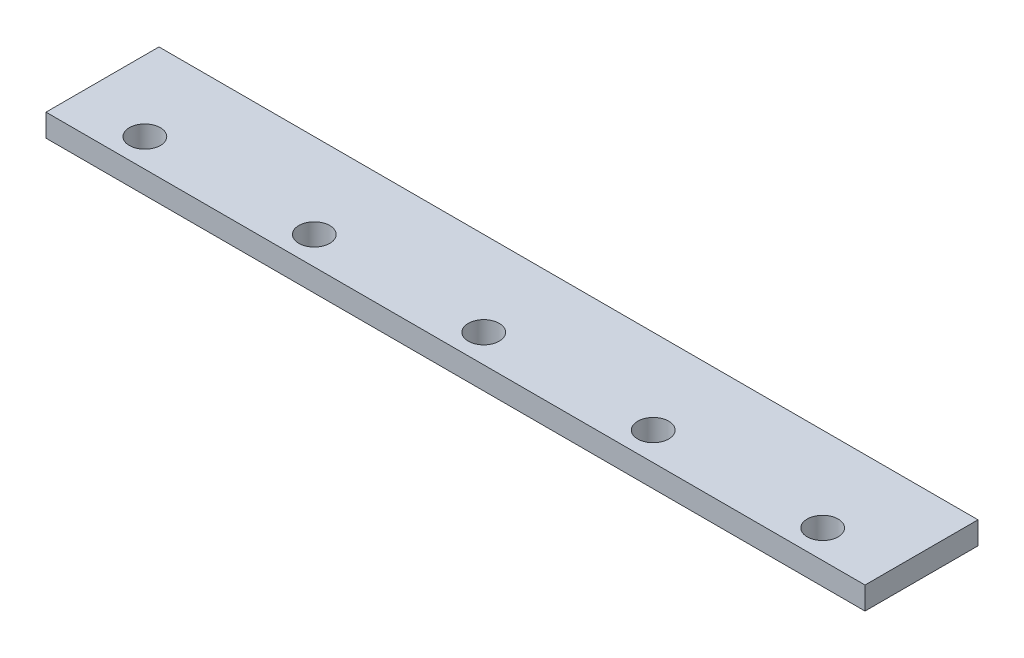
ISO-10303-21;
HEADER;
FILE_DESCRIPTION(('STEP AP214'),'2;1');
FILE_NAME('part.step','',(''),(''),'','','');
FILE_SCHEMA(('AUTOMOTIVE_DESIGN { 1 0 10303 214 1 1 1 1 }'));
ENDSEC;
DATA;
#1=APPLICATION_CONTEXT('core data for automotive mechanical design processes');
#2=APPLICATION_PROTOCOL_DEFINITION('international standard','automotive_design',2000,#1);
#3=PRODUCT_CONTEXT('',#1,'mechanical');
#4=PRODUCT('Part','Part','',(#3));
#5=PRODUCT_RELATED_PRODUCT_CATEGORY('part','',(#4));
#6=PRODUCT_DEFINITION_FORMATION('','',#4);
#7=PRODUCT_DEFINITION_CONTEXT('part definition',#1,'design');
#8=PRODUCT_DEFINITION('design','',#6,#7);
#9=PRODUCT_DEFINITION_SHAPE('','',#8);
#10=(LENGTH_UNIT() NAMED_UNIT(*) SI_UNIT(.MILLI.,.METRE.));
#11=(NAMED_UNIT(*) PLANE_ANGLE_UNIT() SI_UNIT($,.RADIAN.));
#12=(NAMED_UNIT(*) SI_UNIT($,.STERADIAN.) SOLID_ANGLE_UNIT());
#13=UNCERTAINTY_MEASURE_WITH_UNIT(LENGTH_MEASURE(1.E-05),#10,'distance_accuracy_value','');
#14=(GEOMETRIC_REPRESENTATION_CONTEXT(3) GLOBAL_UNCERTAINTY_ASSIGNED_CONTEXT((#13)) GLOBAL_UNIT_ASSIGNED_CONTEXT((#10,
#11,#12)) REPRESENTATION_CONTEXT('',''));
#15=CARTESIAN_POINT('',(0.,0.,0.));
#16=DIRECTION('',(0.,0.,1.));
#17=DIRECTION('',(1.,0.,0.));
#18=AXIS2_PLACEMENT_3D('',#15,#16,#17);
#19=CARTESIAN_POINT('',(20.3152364273204,160.,688.091068301226));
#20=DIRECTION('',(1.,0.,0.));
#21=DIRECTION('',(0.,0.,-1.));
#22=AXIS2_PLACEMENT_3D('',#19,#20,#21);
#23=PLANE('',#22);
#24=DIRECTION('',(0.,0.,1.));
#25=VECTOR('',#24,1.);
#26=CARTESIAN_POINT('',(20.3152364273204,0.,688.091068301226));
#27=LINE('',#26,#25);
#28=CARTESIAN_POINT('',(20.3152364273204,0.,688.091068301226));
#29=VERTEX_POINT('',#28);
#30=CARTESIAN_POINT('',(20.3152364273204,0.,1488.09106830123));
#31=VERTEX_POINT('',#30);
#32=EDGE_CURVE('E102',#29,#31,#27,.T.);
#33=ORIENTED_EDGE('',*,*,#32,.T.);
#34=DIRECTION('',(0.,-1.,0.));
#35=VECTOR('',#34,1.);
#36=CARTESIAN_POINT('',(20.3152364273204,160.,1488.09106830123));
#37=LINE('',#36,#35);
#38=CARTESIAN_POINT('',(20.3152364273204,160.,1488.09106830123));
#39=VERTEX_POINT('',#38);
#40=EDGE_CURVE('E93',#39,#31,#37,.T.);
#41=ORIENTED_EDGE('',*,*,#40,.F.);
#42=DIRECTION('',(0.,0.,1.));
#43=VECTOR('',#42,1.);
#44=CARTESIAN_POINT('',(20.3152364273204,160.,688.091068301226));
#45=LINE('',#44,#43);
#46=CARTESIAN_POINT('',(20.3152364273204,160.,688.091068301226));
#47=VERTEX_POINT('',#46);
#48=EDGE_CURVE('E87',#47,#39,#45,.T.);
#49=ORIENTED_EDGE('',*,*,#48,.F.);
#50=DIRECTION('',(0.,-1.,0.));
#51=VECTOR('',#50,1.);
#52=CARTESIAN_POINT('',(20.3152364273204,160.,688.091068301226));
#53=LINE('',#52,#51);
#54=EDGE_CURVE('E98',#47,#29,#53,.T.);
#55=ORIENTED_EDGE('',*,*,#54,.T.);
#56=EDGE_LOOP('',(#33,#41,#49,#55));
#57=FACE_BOUND('',#56,.T.);
#58=ADVANCED_FACE('F33',(#57),#23,.F.);
#59=CARTESIAN_POINT('',(20.3152364273204,160.,1488.09106830123));
#60=DIRECTION('',(0.,0.,-1.));
#61=DIRECTION('',(-1.,0.,0.));
#62=AXIS2_PLACEMENT_3D('',#59,#60,#61);
#63=PLANE('',#62);
#64=DIRECTION('',(1.,0.,0.));
#65=VECTOR('',#64,1.);
#66=CARTESIAN_POINT('',(20.3152364273204,0.,1488.09106830123));
#67=LINE('',#66,#65);
#68=CARTESIAN_POINT('',(5820.31523642732,0.,1488.09106830123));
#69=VERTEX_POINT('',#68);
#70=EDGE_CURVE('E92',#31,#69,#67,.T.);
#71=ORIENTED_EDGE('',*,*,#70,.T.);
#72=DIRECTION('',(0.,-1.,0.));
#73=VECTOR('',#72,1.);
#74=CARTESIAN_POINT('',(5820.31523642732,160.,1488.09106830123));
#75=LINE('',#74,#73);
#76=CARTESIAN_POINT('',(5820.31523642732,160.,1488.09106830123));
#77=VERTEX_POINT('',#76);
#78=EDGE_CURVE('E90',#77,#69,#75,.T.);
#79=ORIENTED_EDGE('',*,*,#78,.F.);
#80=DIRECTION('',(1.,0.,0.));
#81=VECTOR('',#80,1.);
#82=CARTESIAN_POINT('',(20.3152364273204,160.,1488.09106830123));
#83=LINE('',#82,#81);
#84=EDGE_CURVE('E81',#39,#77,#83,.T.);
#85=ORIENTED_EDGE('',*,*,#84,.F.);
#86=ORIENTED_EDGE('',*,*,#40,.T.);
#87=EDGE_LOOP('',(#71,#79,#85,#86));
#88=FACE_BOUND('',#87,.T.);
#89=ADVANCED_FACE('F91',(#88),#63,.F.);
#90=CARTESIAN_POINT('',(5820.31523642732,160.,688.091068301226));
#91=DIRECTION('',(-1.,0.,0.));
#92=DIRECTION('',(0.,0.,1.));
#93=AXIS2_PLACEMENT_3D('',#90,#91,#92);
#94=PLANE('',#93);
#95=DIRECTION('',(0.,0.,-1.));
#96=VECTOR('',#95,1.);
#97=CARTESIAN_POINT('',(5820.31523642732,0.,688.091068301226));
#98=LINE('',#97,#96);
#99=CARTESIAN_POINT('',(5820.31523642732,0.,688.091068301226));
#100=VERTEX_POINT('',#99);
#101=EDGE_CURVE('E67',#69,#100,#98,.T.);
#102=ORIENTED_EDGE('',*,*,#101,.T.);
#103=DIRECTION('',(0.,-1.,0.));
#104=VECTOR('',#103,1.);
#105=CARTESIAN_POINT('',(5820.31523642732,160.,688.091068301226));
#106=LINE('',#105,#104);
#107=CARTESIAN_POINT('',(5820.31523642732,160.,688.091068301226));
#108=VERTEX_POINT('',#107);
#109=EDGE_CURVE('E94',#108,#100,#106,.T.);
#110=ORIENTED_EDGE('',*,*,#109,.F.);
#111=DIRECTION('',(0.,0.,-1.));
#112=VECTOR('',#111,1.);
#113=CARTESIAN_POINT('',(5820.31523642732,160.,688.091068301226));
#114=LINE('',#113,#112);
#115=EDGE_CURVE('E85',#77,#108,#114,.T.);
#116=ORIENTED_EDGE('',*,*,#115,.F.);
#117=ORIENTED_EDGE('',*,*,#78,.T.);
#118=EDGE_LOOP('',(#102,#110,#116,#117));
#119=FACE_BOUND('',#118,.T.);
#120=ADVANCED_FACE('F96',(#119),#94,.F.);
#121=CARTESIAN_POINT('',(20.3152364273204,160.,688.091068301226));
#122=DIRECTION('',(0.,0.,1.));
#123=DIRECTION('',(1.,0.,0.));
#124=AXIS2_PLACEMENT_3D('',#121,#122,#123);
#125=PLANE('',#124);
#126=DIRECTION('',(-1.,0.,0.));
#127=VECTOR('',#126,1.);
#128=CARTESIAN_POINT('',(20.3152364273204,0.,688.091068301226));
#129=LINE('',#128,#127);
#130=EDGE_CURVE('E73',#100,#29,#129,.T.);
#131=ORIENTED_EDGE('',*,*,#130,.T.);
#132=ORIENTED_EDGE('',*,*,#54,.F.);
#133=DIRECTION('',(-1.,0.,0.));
#134=VECTOR('',#133,1.);
#135=CARTESIAN_POINT('',(20.3152364273204,160.,688.091068301226));
#136=LINE('',#135,#134);
#137=EDGE_CURVE('E50',#108,#47,#136,.T.);
#138=ORIENTED_EDGE('',*,*,#137,.F.);
#139=ORIENTED_EDGE('',*,*,#109,.T.);
#140=EDGE_LOOP('',(#131,#132,#138,#139));
#141=FACE_BOUND('',#140,.T.);
#142=ADVANCED_FACE('F134',(#141),#125,.F.);
#143=CARTESIAN_POINT('',(0.,160.,0.));
#144=DIRECTION('',(0.,1.,0.));
#145=DIRECTION('',(0.,0.,1.));
#146=AXIS2_PLACEMENT_3D('',#143,#144,#145);
#147=PLANE('',#146);
#148=CARTESIAN_POINT('',(1720.31523642732,160.,1288.09106830123));
#149=DIRECTION('',(0.,1.,0.));
#150=DIRECTION('',(0.,0.,1.));
#151=AXIS2_PLACEMENT_3D('',#148,#149,#150);
#152=CIRCLE('',#151,109.705286938289);
#153=CARTESIAN_POINT('',(1720.31523642732,160.,1397.79635523951));
#154=VERTEX_POINT('',#153);
#155=EDGE_CURVE('E242',#154,#154,#152,.T.);
#156=ORIENTED_EDGE('',*,*,#155,.F.);
#157=EDGE_LOOP('',(#156));
#158=FACE_BOUND('',#157,.T.);
#159=CARTESIAN_POINT('',(520.31523642732,160.,1288.09106830123));
#160=DIRECTION('',(0.,1.,0.));
#161=DIRECTION('',(0.,0.,1.));
#162=AXIS2_PLACEMENT_3D('',#159,#160,#161);
#163=CIRCLE('',#162,109.705286938289);
#164=CARTESIAN_POINT('',(520.31523642732,160.,1397.79635523951));
#165=VERTEX_POINT('',#164);
#166=EDGE_CURVE('E241',#165,#165,#163,.T.);
#167=ORIENTED_EDGE('',*,*,#166,.F.);
#168=EDGE_LOOP('',(#167));
#169=FACE_BOUND('',#168,.T.);
#170=ORIENTED_EDGE('',*,*,#48,.T.);
#171=ORIENTED_EDGE('',*,*,#84,.T.);
#172=ORIENTED_EDGE('',*,*,#115,.T.);
#173=ORIENTED_EDGE('',*,*,#137,.T.);
#174=EDGE_LOOP('',(#170,#171,#172,#173));
#175=FACE_BOUND('',#174,.T.);
#176=CARTESIAN_POINT('',(2920.31523642732,160.,1288.09106830123));
#177=DIRECTION('',(0.,1.,0.));
#178=DIRECTION('',(0.,0.,1.));
#179=AXIS2_PLACEMENT_3D('',#176,#177,#178);
#180=CIRCLE('',#179,109.705286938289);
#181=CARTESIAN_POINT('',(2920.31523642732,160.,1397.79635523951));
#182=VERTEX_POINT('',#181);
#183=EDGE_CURVE('E115',#182,#182,#180,.T.);
#184=ORIENTED_EDGE('',*,*,#183,.F.);
#185=EDGE_LOOP('',(#184));
#186=FACE_BOUND('',#185,.T.);
#187=CARTESIAN_POINT('',(4120.31523642732,160.,1288.09106830123));
#188=DIRECTION('',(0.,1.,0.));
#189=DIRECTION('',(0.,0.,1.));
#190=AXIS2_PLACEMENT_3D('',#187,#188,#189);
#191=CIRCLE('',#190,109.705286938289);
#192=CARTESIAN_POINT('',(4120.31523642732,160.,1397.79635523951));
#193=VERTEX_POINT('',#192);
#194=EDGE_CURVE('E121',#193,#193,#191,.T.);
#195=ORIENTED_EDGE('',*,*,#194,.F.);
#196=EDGE_LOOP('',(#195));
#197=FACE_BOUND('',#196,.T.);
#198=CARTESIAN_POINT('',(5320.31523642732,160.,1288.09106830123));
#199=DIRECTION('',(0.,1.,0.));
#200=DIRECTION('',(0.,0.,1.));
#201=AXIS2_PLACEMENT_3D('',#198,#199,#200);
#202=CIRCLE('',#201,109.705286938289);
#203=CARTESIAN_POINT('',(5320.31523642732,160.,1397.79635523951));
#204=VERTEX_POINT('',#203);
#205=EDGE_CURVE('E11',#204,#204,#202,.T.);
#206=ORIENTED_EDGE('',*,*,#205,.F.);
#207=EDGE_LOOP('',(#206));
#208=FACE_BOUND('',#207,.T.);
#209=ADVANCED_FACE('F82',(#158,#169,#175,#186,#197,#208),#147,.T.);
#210=CARTESIAN_POINT('',(0.,0.,0.));
#211=DIRECTION('',(0.,1.,0.));
#212=DIRECTION('',(0.,0.,1.));
#213=AXIS2_PLACEMENT_3D('',#210,#211,#212);
#214=PLANE('',#213);
#215=CARTESIAN_POINT('',(1720.31523642732,0.,1288.09106830123));
#216=DIRECTION('',(0.,1.,0.));
#217=DIRECTION('',(0.,0.,1.));
#218=AXIS2_PLACEMENT_3D('',#215,#216,#217);
#219=CIRCLE('',#218,109.705286938289);
#220=CARTESIAN_POINT('',(1720.31523642732,0.,1397.79635523951));
#221=VERTEX_POINT('',#220);
#222=EDGE_CURVE('E246',#221,#221,#219,.T.);
#223=ORIENTED_EDGE('',*,*,#222,.T.);
#224=EDGE_LOOP('',(#223));
#225=FACE_BOUND('',#224,.T.);
#226=CARTESIAN_POINT('',(520.31523642732,0.,1288.09106830123));
#227=DIRECTION('',(0.,1.,0.));
#228=DIRECTION('',(0.,0.,1.));
#229=AXIS2_PLACEMENT_3D('',#226,#227,#228);
#230=CIRCLE('',#229,109.705286938289);
#231=CARTESIAN_POINT('',(520.31523642732,0.,1397.79635523951));
#232=VERTEX_POINT('',#231);
#233=EDGE_CURVE('E105',#232,#232,#230,.T.);
#234=ORIENTED_EDGE('',*,*,#233,.T.);
#235=EDGE_LOOP('',(#234));
#236=FACE_BOUND('',#235,.T.);
#237=ORIENTED_EDGE('',*,*,#32,.F.);
#238=ORIENTED_EDGE('',*,*,#130,.F.);
#239=ORIENTED_EDGE('',*,*,#101,.F.);
#240=ORIENTED_EDGE('',*,*,#70,.F.);
#241=EDGE_LOOP('',(#237,#238,#239,#240));
#242=FACE_BOUND('',#241,.T.);
#243=CARTESIAN_POINT('',(2920.31523642732,0.,1288.09106830123));
#244=DIRECTION('',(0.,1.,0.));
#245=DIRECTION('',(0.,0.,1.));
#246=AXIS2_PLACEMENT_3D('',#243,#244,#245);
#247=CIRCLE('',#246,109.705286938289);
#248=CARTESIAN_POINT('',(2920.31523642732,0.,1397.79635523951));
#249=VERTEX_POINT('',#248);
#250=EDGE_CURVE('E112',#249,#249,#247,.T.);
#251=ORIENTED_EDGE('',*,*,#250,.T.);
#252=EDGE_LOOP('',(#251));
#253=FACE_BOUND('',#252,.T.);
#254=CARTESIAN_POINT('',(4120.31523642732,0.,1288.09106830123));
#255=DIRECTION('',(0.,1.,0.));
#256=DIRECTION('',(0.,0.,1.));
#257=AXIS2_PLACEMENT_3D('',#254,#255,#256);
#258=CIRCLE('',#257,109.705286938289);
#259=CARTESIAN_POINT('',(4120.31523642732,0.,1397.79635523951));
#260=VERTEX_POINT('',#259);
#261=EDGE_CURVE('E118',#260,#260,#258,.T.);
#262=ORIENTED_EDGE('',*,*,#261,.T.);
#263=EDGE_LOOP('',(#262));
#264=FACE_BOUND('',#263,.T.);
#265=CARTESIAN_POINT('',(5320.31523642732,0.,1288.09106830123));
#266=DIRECTION('',(0.,1.,0.));
#267=DIRECTION('',(0.,0.,1.));
#268=AXIS2_PLACEMENT_3D('',#265,#266,#267);
#269=CIRCLE('',#268,109.705286938289);
#270=CARTESIAN_POINT('',(5320.31523642732,0.,1397.79635523951));
#271=VERTEX_POINT('',#270);
#272=EDGE_CURVE('E42',#271,#271,#269,.T.);
#273=ORIENTED_EDGE('',*,*,#272,.T.);
#274=EDGE_LOOP('',(#273));
#275=FACE_BOUND('',#274,.T.);
#276=ADVANCED_FACE('F126',(#225,#236,#242,#253,#264,#275),#214,.F.);
#277=CARTESIAN_POINT('',(520.31523642732,0.,1288.09106830123));
#278=DIRECTION('',(0.,1.,0.));
#279=DIRECTION('',(0.,0.,1.));
#280=AXIS2_PLACEMENT_3D('',#277,#278,#279);
#281=CYLINDRICAL_SURFACE('',#280,109.705286938289);
#282=ORIENTED_EDGE('',*,*,#233,.F.);
#283=EDGE_LOOP('',(#282));
#284=FACE_BOUND('',#283,.T.);
#285=ORIENTED_EDGE('',*,*,#166,.T.);
#286=EDGE_LOOP('',(#285));
#287=FACE_BOUND('',#286,.T.);
#288=ADVANCED_FACE('F141',(#284,#287),#281,.F.);
#289=CARTESIAN_POINT('',(1720.31523642732,0.,1288.09106830123));
#290=DIRECTION('',(0.,1.,0.));
#291=DIRECTION('',(0.,0.,1.));
#292=AXIS2_PLACEMENT_3D('',#289,#290,#291);
#293=CYLINDRICAL_SURFACE('',#292,109.705286938289);
#294=ORIENTED_EDGE('',*,*,#222,.F.);
#295=EDGE_LOOP('',(#294));
#296=FACE_BOUND('',#295,.T.);
#297=ORIENTED_EDGE('',*,*,#155,.T.);
#298=EDGE_LOOP('',(#297));
#299=FACE_BOUND('',#298,.T.);
#300=ADVANCED_FACE('F159',(#296,#299),#293,.F.);
#301=CARTESIAN_POINT('',(2920.31523642732,0.,1288.09106830123));
#302=DIRECTION('',(0.,1.,0.));
#303=DIRECTION('',(0.,0.,1.));
#304=AXIS2_PLACEMENT_3D('',#301,#302,#303);
#305=CYLINDRICAL_SURFACE('',#304,109.705286938289);
#306=ORIENTED_EDGE('',*,*,#250,.F.);
#307=EDGE_LOOP('',(#306));
#308=FACE_BOUND('',#307,.T.);
#309=ORIENTED_EDGE('',*,*,#183,.T.);
#310=EDGE_LOOP('',(#309));
#311=FACE_BOUND('',#310,.T.);
#312=ADVANCED_FACE('F157',(#308,#311),#305,.F.);
#313=CARTESIAN_POINT('',(4120.31523642732,0.,1288.09106830123));
#314=DIRECTION('',(0.,1.,0.));
#315=DIRECTION('',(0.,0.,1.));
#316=AXIS2_PLACEMENT_3D('',#313,#314,#315);
#317=CYLINDRICAL_SURFACE('',#316,109.705286938289);
#318=ORIENTED_EDGE('',*,*,#261,.F.);
#319=EDGE_LOOP('',(#318));
#320=FACE_BOUND('',#319,.T.);
#321=ORIENTED_EDGE('',*,*,#194,.T.);
#322=EDGE_LOOP('',(#321));
#323=FACE_BOUND('',#322,.T.);
#324=ADVANCED_FACE('F130',(#320,#323),#317,.F.);
#325=CARTESIAN_POINT('',(5320.31523642732,0.,1288.09106830123));
#326=DIRECTION('',(0.,1.,0.));
#327=DIRECTION('',(0.,0.,1.));
#328=AXIS2_PLACEMENT_3D('',#325,#326,#327);
#329=CYLINDRICAL_SURFACE('',#328,109.705286938289);
#330=ORIENTED_EDGE('',*,*,#272,.F.);
#331=EDGE_LOOP('',(#330));
#332=FACE_BOUND('',#331,.T.);
#333=ORIENTED_EDGE('',*,*,#205,.T.);
#334=EDGE_LOOP('',(#333));
#335=FACE_BOUND('',#334,.T.);
#336=ADVANCED_FACE('F35',(#332,#335),#329,.F.);
#337=CLOSED_SHELL('',(#58,#89,#120,#142,#209,#276,#288,#300,#312,#324,#336));
#338=MANIFOLD_SOLID_BREP('B2',#337);
#339=ADVANCED_BREP_SHAPE_REPRESENTATION('',(#18,#338),#14);
#340=SHAPE_DEFINITION_REPRESENTATION(#9,#339);
ENDSEC;
END-ISO-10303-21;
